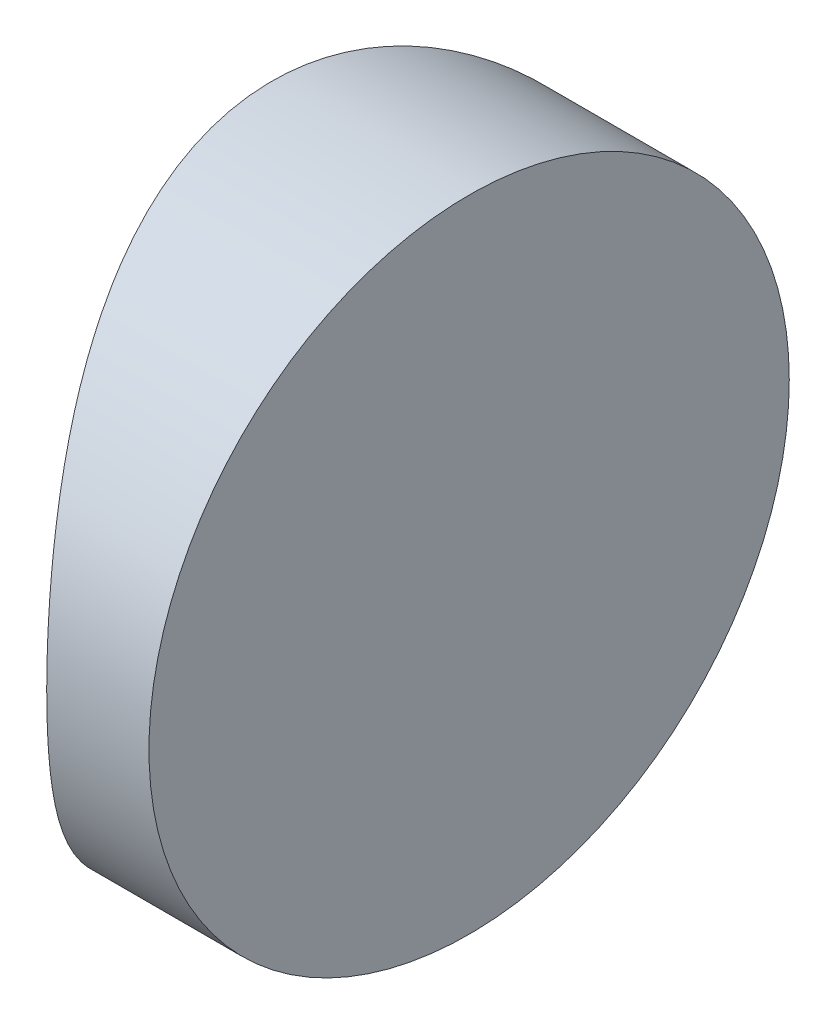
ISO-10303-21;
HEADER;
FILE_DESCRIPTION(('STEP AP214'),'2;1');
FILE_NAME('part.step','',(''),(''),'','','');
FILE_SCHEMA(('AUTOMOTIVE_DESIGN { 1 0 10303 214 1 1 1 1 }'));
ENDSEC;
DATA;
#1=APPLICATION_CONTEXT('core data for automotive mechanical design processes');
#2=APPLICATION_PROTOCOL_DEFINITION('international standard','automotive_design',2000,#1);
#3=PRODUCT_CONTEXT('',#1,'mechanical');
#4=PRODUCT('Part','Part','',(#3));
#5=PRODUCT_RELATED_PRODUCT_CATEGORY('part','',(#4));
#6=PRODUCT_DEFINITION_FORMATION('','',#4);
#7=PRODUCT_DEFINITION_CONTEXT('part definition',#1,'design');
#8=PRODUCT_DEFINITION('design','',#6,#7);
#9=PRODUCT_DEFINITION_SHAPE('','',#8);
#10=(LENGTH_UNIT() NAMED_UNIT(*) SI_UNIT(.MILLI.,.METRE.));
#11=(NAMED_UNIT(*) PLANE_ANGLE_UNIT() SI_UNIT($,.RADIAN.));
#12=(NAMED_UNIT(*) SI_UNIT($,.STERADIAN.) SOLID_ANGLE_UNIT());
#13=UNCERTAINTY_MEASURE_WITH_UNIT(LENGTH_MEASURE(1.E-05),#10,'distance_accuracy_value','');
#14=(GEOMETRIC_REPRESENTATION_CONTEXT(3) GLOBAL_UNCERTAINTY_ASSIGNED_CONTEXT((#13)) GLOBAL_UNIT_ASSIGNED_CONTEXT((#10,
#11,#12)) REPRESENTATION_CONTEXT('',''));
#15=CARTESIAN_POINT('',(0.,0.,0.));
#16=DIRECTION('',(0.,0.,1.));
#17=DIRECTION('',(1.,0.,0.));
#18=AXIS2_PLACEMENT_3D('',#15,#16,#17);
#19=CARTESIAN_POINT('',(4.35520433485127,12.5,0.));
#20=DIRECTION('',(0.,-1.,0.));
#21=DIRECTION('',(0.,0.,-1.));
#22=AXIS2_PLACEMENT_3D('',#19,#20,#21);
#23=CYLINDRICAL_SURFACE('',#22,11.46);
#24=CARTESIAN_POINT('',(-7.10479566514874,0.,0.));
#25=CARTESIAN_POINT('',(-7.10479524372138,4.77944507062317E-07,-0.16259338800204));
#26=CARTESIAN_POINT('',(-7.10132747983063,0.00635238463422841,-0.325194274202398));
#27=CARTESIAN_POINT('',(-7.08754574817177,0.0316770075377767,-0.649120136136757));
#28=CARTESIAN_POINT('',(-7.07723137183561,0.0506504769369664,-0.810445035145482));
#29=CARTESIAN_POINT('',(-7.050018718027,0.100978877587475,-1.1306223029213));
#30=CARTESIAN_POINT('',(-7.03311890716807,0.132336692496561,-1.28947408687038));
#31=CARTESIAN_POINT('',(-6.99315149978321,0.207064003468726,-1.60359082340573));
#32=CARTESIAN_POINT('',(-6.97008145035329,0.250438276776335,-1.75885432278627));
#33=CARTESIAN_POINT('',(-6.91843773521695,0.34850545829243,-2.06408437411231));
#34=CARTESIAN_POINT('',(-6.88988756122792,0.403150125504513,-2.21407041306104));
#35=CARTESIAN_POINT('',(-6.82787558071404,0.523324447796248,-2.50858871290263));
#36=CARTESIAN_POINT('',(-6.79441192463321,0.588858203025799,-2.65311889420856));
#37=CARTESIAN_POINT('',(-6.68774203220462,0.800909392080872,-3.07728818227995));
#38=CARTESIAN_POINT('',(-6.60821282545469,0.962957887653652,-3.34775559244392));
#39=CARTESIAN_POINT('',(-6.43309068255825,1.33602762316018,-3.87649344919014));
#40=CARTESIAN_POINT('',(-6.33677354355159,1.54962770900226,-4.13268747394735));
#41=CARTESIAN_POINT('',(-6.14087135672749,2.0140859095654,-4.60760920405627));
#42=CARTESIAN_POINT('',(-6.04128320294472,2.26498028317324,-4.82629999670228));
#43=CARTESIAN_POINT('',(-5.8387924126366,2.82609403539738,-5.24141128929247));
#44=CARTESIAN_POINT('',(-5.73650203168586,3.13970508860957,-5.43362711243348));
#45=CARTESIAN_POINT('',(-5.59882592076435,3.63489229120397,-5.67959024795813));
#46=CARTESIAN_POINT('',(-5.55556389381974,3.80406551387287,-5.75451264478895));
#47=CARTESIAN_POINT('',(-5.47594546690415,4.14984522709876,-5.88950180408098));
#48=CARTESIAN_POINT('',(-5.43958696341811,4.32644943332196,-5.94957309338986));
#49=CARTESIAN_POINT('',(-5.38245539794896,4.64626583799386,-6.04250507414995));
#50=CARTESIAN_POINT('',(-5.36001312144738,4.78829547036669,-6.07844430405884));
#51=CARTESIAN_POINT('',(-5.3209955234548,5.07529305441421,-6.14036638022317));
#52=CARTESIAN_POINT('',(-5.304419078511,5.22026043780705,-6.16635113308765));
#53=CARTESIAN_POINT('',(-5.27767437022123,5.51218814943694,-6.20804832739678));
#54=CARTESIAN_POINT('',(-5.26750322688545,5.65914755160423,-6.22376538558235));
#55=CARTESIAN_POINT('',(-5.253905077124,5.95406944068207,-6.24473957290409));
#56=CARTESIAN_POINT('',(-5.25047564147369,6.10203154699937,-6.25000046969333));
#57=CARTESIAN_POINT('',(-5.25047696477413,6.41056016363299,-6.24999949033706));
#58=CARTESIAN_POINT('',(-5.2545163419325,6.57112780007986,-6.24380405797819));
#59=CARTESIAN_POINT('',(-5.27050930107044,6.8909185544135,-6.21911962840553));
#60=CARTESIAN_POINT('',(-5.28246342383325,7.0501415796754,-6.20062979116337));
#61=CARTESIAN_POINT('',(-5.31381743025778,7.36606832090023,-6.15162261993577));
#62=CARTESIAN_POINT('',(-5.33322168619304,7.52277050107831,-6.12109822292263));
#63=CARTESIAN_POINT('',(-5.37875497621063,7.83251442192578,-6.04842715890638));
#64=CARTESIAN_POINT('',(-5.40488693172636,7.98555454075012,-6.00627544229146));
#65=CARTESIAN_POINT('',(-5.46278572815512,8.28603257544147,-5.91115429982899));
#66=CARTESIAN_POINT('',(-5.49451594677691,8.43349976355685,-5.85825486093031));
#67=CARTESIAN_POINT('',(-5.5627419386504,8.72313432667024,-5.74199336786202));
#68=CARTESIAN_POINT('',(-5.59923957709298,8.86529959923152,-5.67862721614705));
#69=CARTESIAN_POINT('',(-5.71434045230826,9.28284572105636,-5.47360942691276));
#70=CARTESIAN_POINT('',(-5.79859254481931,9.5494770044604,-5.31697432575312));
#71=CARTESIAN_POINT('',(-5.98268496609094,10.080277096748,-4.95033161089442));
#72=CARTESIAN_POINT('',(-6.08324262046991,10.3415811143038,-4.73657216702361));
#73=CARTESIAN_POINT('',(-6.28292316790584,10.8270745404895,-4.2692264609488));
#74=CARTESIAN_POINT('',(-6.38204507293876,11.0512394046935,-4.01561407482027));
#75=CARTESIAN_POINT('',(-6.52665444761068,11.364218352,-3.59737357580281));
#76=CARTESIAN_POINT('',(-6.57594377238503,11.4680568897847,-3.44507559102255));
#77=CARTESIAN_POINT('',(-6.67003273071768,11.6623922938861,-3.13090723946184));
#78=CARTESIAN_POINT('',(-6.71483425305848,11.7528947805686,-2.96904094569602));
#79=CARTESIAN_POINT('',(-6.79863044620864,11.9195779773677,-2.63683565668467));
#80=CARTESIAN_POINT('',(-6.83762993869677,11.9957705934367,-2.46650385540004));
#81=CARTESIAN_POINT('',(-6.90868716179541,12.1329925529442,-2.11845718028463));
#82=CARTESIAN_POINT('',(-6.94074674170157,12.1940259365414,-1.94074428839262));
#83=CARTESIAN_POINT('',(-6.99085116041578,12.2886348836937,-1.61839634799841));
#84=CARTESIAN_POINT('',(-7.01042736232052,12.325293449343,-1.47489551702796));
#85=CARTESIAN_POINT('',(-7.04429146377624,12.3884131911116,-1.18506126896963));
#86=CARTESIAN_POINT('',(-7.05858009109988,12.4148757706095,-1.0387282446197));
#87=CARTESIAN_POINT('',(-7.08156501154187,12.4573272548032,-0.744132461846475));
#88=CARTESIAN_POINT('',(-7.09026200168883,12.4733174649425,-0.595869946296664));
#89=CARTESIAN_POINT('',(-7.10187654585295,12.4946522590523,-0.29840683598802));
#90=CARTESIAN_POINT('',(-7.10479605187868,12.5000004385939,-0.149206575157631));
#91=CARTESIAN_POINT('',(-7.10479524372138,12.4999995220555,0.162593388002033));
#92=CARTESIAN_POINT('',(-7.10132747983064,12.4936476153658,0.325194274202391));
#93=CARTESIAN_POINT('',(-7.08754574817178,12.4683229924622,0.64912013613675));
#94=CARTESIAN_POINT('',(-7.07723137183561,12.449349523063,0.810445035145475));
#95=CARTESIAN_POINT('',(-7.050018718027,12.3990211224125,1.13062230292129));
#96=CARTESIAN_POINT('',(-7.03311890716807,12.3676633075034,1.28947408687037));
#97=CARTESIAN_POINT('',(-6.99315149978321,12.2929359965313,1.60359082340572));
#98=CARTESIAN_POINT('',(-6.97008145035329,12.2495617232237,1.75885432278627));
#99=CARTESIAN_POINT('',(-6.91843773521695,12.1514945417076,2.0640843741123));
#100=CARTESIAN_POINT('',(-6.88988756122792,12.0968498744955,2.21407041306104));
#101=CARTESIAN_POINT('',(-6.82787558071405,11.9766755522038,2.50858871290263));
#102=CARTESIAN_POINT('',(-6.79441192463321,11.9111417969742,2.65311889420856));
#103=CARTESIAN_POINT('',(-6.68774203220462,11.6990906079191,3.07728818227994));
#104=CARTESIAN_POINT('',(-6.60821282545469,11.5370421123463,3.34775559244391));
#105=CARTESIAN_POINT('',(-6.43309068255825,11.1639723768398,3.87649344919013));
#106=CARTESIAN_POINT('',(-6.33677354355159,10.9503722909977,4.13268747394734));
#107=CARTESIAN_POINT('',(-6.14087135672749,10.4859140904346,4.60760920405626));
#108=CARTESIAN_POINT('',(-6.04128320294472,10.2350197168268,4.82629999670228));
#109=CARTESIAN_POINT('',(-5.8387924126366,9.67390596460261,5.24141128929247));
#110=CARTESIAN_POINT('',(-5.73650203168586,9.36029491139043,5.43362711243347));
#111=CARTESIAN_POINT('',(-5.59882592076436,8.86510770879603,5.67959024795812));
#112=CARTESIAN_POINT('',(-5.55556389381974,8.69593448612713,5.75451264478894));
#113=CARTESIAN_POINT('',(-5.47594546690415,8.35015477290124,5.88950180408097));
#114=CARTESIAN_POINT('',(-5.43958696341811,8.17355056667804,5.94957309338986));
#115=CARTESIAN_POINT('',(-5.38245539794896,7.85373416200615,6.04250507414995));
#116=CARTESIAN_POINT('',(-5.36001312144738,7.71170452963331,6.07844430405884));
#117=CARTESIAN_POINT('',(-5.3209955234548,7.42470694558579,6.14036638022317));
#118=CARTESIAN_POINT('',(-5.304419078511,7.27973956219295,6.16635113308764));
#119=CARTESIAN_POINT('',(-5.27767437022124,6.98781185056306,6.20804832739677));
#120=CARTESIAN_POINT('',(-5.26750322688546,6.84085244839578,6.22376538558234));
#121=CARTESIAN_POINT('',(-5.253905077124,6.54593055931794,6.24473957290408));
#122=CARTESIAN_POINT('',(-5.2504756414737,6.39796845300063,6.25000046969332));
#123=CARTESIAN_POINT('',(-5.25047696477414,6.08943983636702,6.24999949033705));
#124=CARTESIAN_POINT('',(-5.2545163419325,5.92887219992014,6.24380405797819));
#125=CARTESIAN_POINT('',(-5.27050930107044,5.6090814455865,6.21911962840552));
#126=CARTESIAN_POINT('',(-5.28246342383325,5.44985842032461,6.20062979116336));
#127=CARTESIAN_POINT('',(-5.31381743025779,5.13393167909977,6.15162261993576));
#128=CARTESIAN_POINT('',(-5.33322168619304,4.97722949892169,6.12109822292262));
#129=CARTESIAN_POINT('',(-5.37875497621064,4.66748557807423,6.04842715890637));
#130=CARTESIAN_POINT('',(-5.40488693172636,4.51444545924988,6.00627544229145));
#131=CARTESIAN_POINT('',(-5.46278572815512,4.21396742455852,5.91115429982898));
#132=CARTESIAN_POINT('',(-5.49451594677692,4.06650023644314,5.8582548609303));
#133=CARTESIAN_POINT('',(-5.56274193865041,3.77686567332976,5.74199336786201));
#134=CARTESIAN_POINT('',(-5.59923957709298,3.63470040076848,5.67862721614704));
#135=CARTESIAN_POINT('',(-5.71434045230827,3.21715427894363,5.47360942691275));
#136=CARTESIAN_POINT('',(-5.79859254481932,2.95052299553959,5.31697432575311));
#137=CARTESIAN_POINT('',(-5.98268496609094,2.41972290325204,4.95033161089441));
#138=CARTESIAN_POINT('',(-6.08324262046991,2.15841888569616,4.7365721670236));
#139=CARTESIAN_POINT('',(-6.28292316790585,1.67292545951052,4.26922646094879));
#140=CARTESIAN_POINT('',(-6.38204507293876,1.44876059530654,4.01561407482026));
#141=CARTESIAN_POINT('',(-6.52665444761069,1.13578164799995,3.5973735758028));
#142=CARTESIAN_POINT('',(-6.57594377238504,1.03194311021527,3.44507559102254));
#143=CARTESIAN_POINT('',(-6.67003273071768,0.837607706113849,3.13090723946183));
#144=CARTESIAN_POINT('',(-6.71483425305848,0.747105219431373,2.96904094569601));
#145=CARTESIAN_POINT('',(-6.79863044620863,0.58042202263231,2.63683565668466));
#146=CARTESIAN_POINT('',(-6.83762993869677,0.504229406563327,2.46650385540003));
#147=CARTESIAN_POINT('',(-6.90868716179541,0.367007447055813,2.11845718028462));
#148=CARTESIAN_POINT('',(-6.94074674170157,0.305974063458602,1.94074428839261));
#149=CARTESIAN_POINT('',(-6.99085116041578,0.211365116306331,1.61839634799839));
#150=CARTESIAN_POINT('',(-7.01042736232053,0.174706550657028,1.47489551702795));
#151=CARTESIAN_POINT('',(-7.04429146377624,0.111586808888431,1.18506126896961));
#152=CARTESIAN_POINT('',(-7.05858009109988,0.0851242293904919,1.03872824461968));
#153=CARTESIAN_POINT('',(-7.08156501154186,0.0426727451968441,0.744132461846464));
#154=CARTESIAN_POINT('',(-7.09026200168883,0.0266825350575131,0.595869946296653));
#155=CARTESIAN_POINT('',(-7.10187654585296,0.00534774094766428,0.298406835988013));
#156=CARTESIAN_POINT('',(-7.10479605187868,-4.38593868363665E-07,0.149206575157624));
#157=CARTESIAN_POINT('',(-7.10479566514874,0.,0.));
#158=B_SPLINE_CURVE_WITH_KNOTS('',3,(#24,#25,#26,#27,#28,#29,#30,#31,#32,#33,#34,#35,#36,#37,
#38,#39,#40,#41,#42,#43,#44,#45,#46,#47,#48,#49,#50,#51,#52,#53,#54,#55,#56,#57,#58,#59,#60,#61,
#62,#63,#64,#65,#66,#67,#68,#69,#70,#71,#72,#73,#74,#75,#76,#77,#78,#79,#80,#81,#82,#83,#84,#85,
#86,#87,#88,#89,#90,#91,#92,#93,#94,#95,#96,#97,#98,#99,#100,#101,#102,#103,#104,#105,#106,#107,
#108,#109,#110,#111,#112,#113,#114,#115,#116,#117,#118,#119,#120,#121,#122,#123,#124,#125,#126,
#127,#128,#129,#130,#131,#132,#133,#134,#135,#136,#137,#138,#139,#140,#141,#142,#143,#144,#145,
#146,#147,#148,#149,#150,#151,#152,#153,#154,#155,#156,#157),.UNSPECIFIED.,.T.,.F.,(4,2,2,2,2,2,
2,2,2,2,2,2,2,2,2,2,2,2,2,2,2,2,2,2,2,2,2,2,2,2,2,2,2,2,2,2,2,2,2,2,2,2,2,2,2,2,2,2,2,2,2,2,2,2,
2,2,2,2,2,2,2,2,2,2,2,2,4),(0.,0.487633349831497,0.975295801546895,1.46307187101466,
1.95104213894644,2.4369655377853,2.92307232136158,3.89449669404815,4.93190623865574,
5.97033106927626,7.10927103977482,7.67863055105749,8.24781629816697,8.69202352705715,
9.13614563309691,9.58006790747237,10.0238301949748,10.505355439381,10.9869135878959,
11.4687547823932,11.9508055653587,12.4298125315693,12.9090074674889,13.8667619220202,
14.9194683634858,15.9728677633905,16.5446479890648,17.1161865493559,17.6872474567159,
18.2581560042289,18.7059097386946,19.1536018221651,19.6012380875059,20.0487230864659,
20.5363564362974,21.0240188880128,21.5117949574806,21.9997652254124,22.4856886242512,
22.9717954078275,23.9432197805141,24.9806293251217,26.0190541557422,27.1579941262408,
27.7273536375234,28.2965393846329,28.7407466135231,29.1848687195628,29.6287909939383,
30.0725532814407,30.5540785258469,31.0356366743618,31.5174778688592,31.9995286518246,
32.4785356180352,32.9577305539549,33.9154850084862,34.9681914499518,36.0215908498565,
36.5933710755308,37.1649096358218,37.7359705431819,38.3068790906948,38.7546328251606,
39.2023249086311,39.6499611739718,40.0974461729319),.UNSPECIFIED.);
#159=CARTESIAN_POINT('',(-7.10479566514874,0.,0.));
#160=VERTEX_POINT('',#159);
#161=EDGE_CURVE('E10',#160,#160,#158,.T.);
#162=ORIENTED_EDGE('',*,*,#161,.F.);
#163=EDGE_LOOP('',(#162));
#164=FACE_BOUND('',#163,.T.);
#165=ADVANCED_FACE('F35',(#164),#23,.T.);
#166=CARTESIAN_POINT('',(-3.25479566514874,12.5,-6.25));
#167=DIRECTION('',(1.,0.,0.));
#168=DIRECTION('',(0.,0.,-1.));
#169=AXIS2_PLACEMENT_3D('',#166,#167,#168);
#170=PLANE('',#169);
#171=CARTESIAN_POINT('',(-3.25479566514874,6.25,0.));
#172=DIRECTION('',(1.,0.,0.));
#173=DIRECTION('',(0.,0.,-1.));
#174=AXIS2_PLACEMENT_3D('',#171,#172,#173);
#175=CIRCLE('',#174,6.25);
#176=CARTESIAN_POINT('',(-3.25479566514874,6.25,-6.25));
#177=VERTEX_POINT('',#176);
#178=EDGE_CURVE('E45',#177,#177,#175,.T.);
#179=ORIENTED_EDGE('',*,*,#178,.T.);
#180=EDGE_LOOP('',(#179));
#181=FACE_BOUND('',#180,.T.);
#182=ADVANCED_FACE('F37',(#181),#170,.T.);
#183=CARTESIAN_POINT('',(-15.9547956651487,6.25,0.));
#184=DIRECTION('',(1.,0.,0.));
#185=DIRECTION('',(0.,0.,-1.));
#186=AXIS2_PLACEMENT_3D('',#183,#184,#185);
#187=CYLINDRICAL_SURFACE('',#186,6.25);
#188=ORIENTED_EDGE('',*,*,#178,.F.);
#189=EDGE_LOOP('',(#188));
#190=FACE_BOUND('',#189,.T.);
#191=ORIENTED_EDGE('',*,*,#161,.T.);
#192=EDGE_LOOP('',(#191));
#193=FACE_BOUND('',#192,.T.);
#194=ADVANCED_FACE('F52',(#190,#193),#187,.T.);
#195=CLOSED_SHELL('',(#165,#182,#194));
#196=MANIFOLD_SOLID_BREP('B2',#195);
#197=ADVANCED_BREP_SHAPE_REPRESENTATION('',(#18,#196),#14);
#198=SHAPE_DEFINITION_REPRESENTATION(#9,#197);
ENDSEC;
END-ISO-10303-21;
